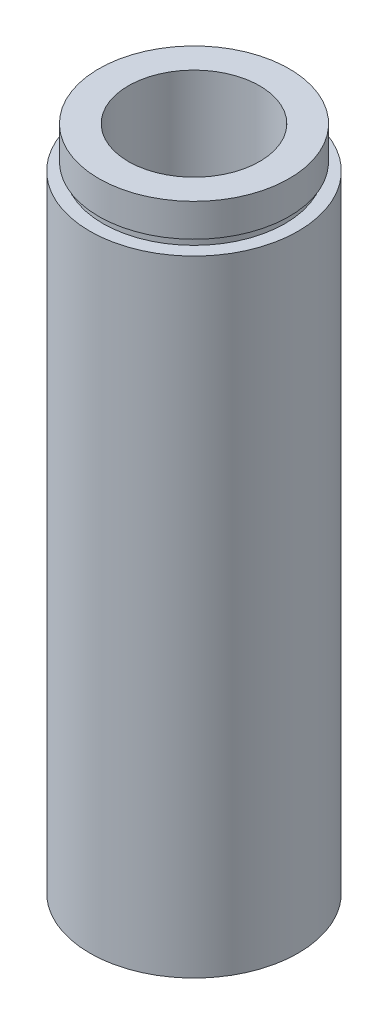
ISO-10303-21;
HEADER;
FILE_DESCRIPTION(('STEP AP214'),'2;1');
FILE_NAME('part.step','',(''),(''),'','','');
FILE_SCHEMA(('AUTOMOTIVE_DESIGN { 1 0 10303 214 1 1 1 1 }'));
ENDSEC;
DATA;
#1=APPLICATION_CONTEXT('core data for automotive mechanical design processes');
#2=APPLICATION_PROTOCOL_DEFINITION('international standard','automotive_design',2000,#1);
#3=PRODUCT_CONTEXT('',#1,'mechanical');
#4=PRODUCT('Part','Part','',(#3));
#5=PRODUCT_RELATED_PRODUCT_CATEGORY('part','',(#4));
#6=PRODUCT_DEFINITION_FORMATION('','',#4);
#7=PRODUCT_DEFINITION_CONTEXT('part definition',#1,'design');
#8=PRODUCT_DEFINITION('design','',#6,#7);
#9=PRODUCT_DEFINITION_SHAPE('','',#8);
#10=(LENGTH_UNIT() NAMED_UNIT(*) SI_UNIT(.MILLI.,.METRE.));
#11=(NAMED_UNIT(*) PLANE_ANGLE_UNIT() SI_UNIT($,.RADIAN.));
#12=(NAMED_UNIT(*) SI_UNIT($,.STERADIAN.) SOLID_ANGLE_UNIT());
#13=UNCERTAINTY_MEASURE_WITH_UNIT(LENGTH_MEASURE(1.E-05),#10,'distance_accuracy_value','');
#14=(GEOMETRIC_REPRESENTATION_CONTEXT(3) GLOBAL_UNCERTAINTY_ASSIGNED_CONTEXT((#13)) GLOBAL_UNIT_ASSIGNED_CONTEXT((#10,
#11,#12)) REPRESENTATION_CONTEXT('',''));
#15=CARTESIAN_POINT('',(0.,0.,0.));
#16=DIRECTION('',(0.,0.,1.));
#17=DIRECTION('',(1.,0.,0.));
#18=AXIS2_PLACEMENT_3D('',#15,#16,#17);
#19=CARTESIAN_POINT('',(11.1,0.,0.));
#20=DIRECTION('',(0.,1.,0.));
#21=DIRECTION('',(0.,0.,1.));
#22=AXIS2_PLACEMENT_3D('',#19,#20,#21);
#23=PLANE('',#22);
#24=CARTESIAN_POINT('',(0.,0.,0.));
#25=DIRECTION('',(0.,1.,0.));
#26=DIRECTION('',(0.,0.,1.));
#27=AXIS2_PLACEMENT_3D('',#24,#25,#26);
#28=CIRCLE('',#27,12.7);
#29=CARTESIAN_POINT('',(0.,0.,12.7));
#30=VERTEX_POINT('',#29);
#31=EDGE_CURVE('E10',#30,#30,#28,.T.);
#32=ORIENTED_EDGE('',*,*,#31,.F.);
#33=EDGE_LOOP('',(#32));
#34=FACE_BOUND('',#33,.T.);
#35=CARTESIAN_POINT('',(0.,0.,0.));
#36=DIRECTION('',(0.,1.,0.));
#37=DIRECTION('',(0.,0.,1.));
#38=AXIS2_PLACEMENT_3D('',#35,#36,#37);
#39=CIRCLE('',#38,11.1);
#40=CARTESIAN_POINT('',(0.,0.,11.1));
#41=VERTEX_POINT('',#40);
#42=EDGE_CURVE('E75',#41,#41,#39,.T.);
#43=ORIENTED_EDGE('',*,*,#42,.T.);
#44=EDGE_LOOP('',(#43));
#45=FACE_BOUND('',#44,.T.);
#46=ADVANCED_FACE('F35',(#34,#45),#23,.F.);
#47=CARTESIAN_POINT('',(0.,161.376166943427,0.));
#48=DIRECTION('',(0.,1.,0.));
#49=DIRECTION('',(0.,0.,1.));
#50=AXIS2_PLACEMENT_3D('',#47,#48,#49);
#51=CYLINDRICAL_SURFACE('',#50,12.7);
#52=CARTESIAN_POINT('',(0.,76.2,0.));
#53=DIRECTION('',(0.,1.,0.));
#54=DIRECTION('',(0.,0.,1.));
#55=AXIS2_PLACEMENT_3D('',#52,#53,#54);
#56=CIRCLE('',#55,12.7);
#57=CARTESIAN_POINT('',(0.,76.2,12.7));
#58=VERTEX_POINT('',#57);
#59=EDGE_CURVE('E41',#58,#58,#56,.T.);
#60=ORIENTED_EDGE('',*,*,#59,.F.);
#61=EDGE_LOOP('',(#60));
#62=FACE_BOUND('',#61,.T.);
#63=ORIENTED_EDGE('',*,*,#31,.T.);
#64=EDGE_LOOP('',(#63));
#65=FACE_BOUND('',#64,.T.);
#66=ADVANCED_FACE('F136',(#62,#65),#51,.T.);
#67=CARTESIAN_POINT('',(12.7,76.2,0.));
#68=DIRECTION('',(0.,-1.,0.));
#69=DIRECTION('',(0.,0.,-1.));
#70=AXIS2_PLACEMENT_3D('',#67,#68,#69);
#71=PLANE('',#70);
#72=CARTESIAN_POINT('',(0.,76.2,0.));
#73=DIRECTION('',(0.,1.,0.));
#74=DIRECTION('',(0.,0.,1.));
#75=AXIS2_PLACEMENT_3D('',#72,#73,#74);
#76=CIRCLE('',#75,11.1);
#77=CARTESIAN_POINT('',(0.,76.2,11.1));
#78=VERTEX_POINT('',#77);
#79=EDGE_CURVE('E45',#78,#78,#76,.T.);
#80=ORIENTED_EDGE('',*,*,#79,.F.);
#81=EDGE_LOOP('',(#80));
#82=FACE_BOUND('',#81,.T.);
#83=ORIENTED_EDGE('',*,*,#59,.T.);
#84=EDGE_LOOP('',(#83));
#85=FACE_BOUND('',#84,.T.);
#86=ADVANCED_FACE('F131',(#82,#85),#71,.F.);
#87=CARTESIAN_POINT('',(0.,161.376166943427,0.));
#88=DIRECTION('',(0.,1.,0.));
#89=DIRECTION('',(0.,0.,1.));
#90=AXIS2_PLACEMENT_3D('',#87,#88,#89);
#91=CYLINDRICAL_SURFACE('',#90,11.1);
#92=CARTESIAN_POINT('',(0.,77.2,0.));
#93=DIRECTION('',(0.,1.,0.));
#94=DIRECTION('',(0.,0.,1.));
#95=AXIS2_PLACEMENT_3D('',#92,#93,#94);
#96=CIRCLE('',#95,11.1);
#97=CARTESIAN_POINT('',(0.,77.2,11.1));
#98=VERTEX_POINT('',#97);
#99=EDGE_CURVE('E49',#98,#98,#96,.T.);
#100=ORIENTED_EDGE('',*,*,#99,.F.);
#101=EDGE_LOOP('',(#100));
#102=FACE_BOUND('',#101,.T.);
#103=ORIENTED_EDGE('',*,*,#79,.T.);
#104=EDGE_LOOP('',(#103));
#105=FACE_BOUND('',#104,.T.);
#106=ADVANCED_FACE('F125',(#102,#105),#91,.T.);
#107=CARTESIAN_POINT('',(11.1,77.2,0.));
#108=DIRECTION('',(0.,1.,0.));
#109=DIRECTION('',(0.,0.,1.));
#110=AXIS2_PLACEMENT_3D('',#107,#108,#109);
#111=PLANE('',#110);
#112=CARTESIAN_POINT('',(0.,77.2,0.));
#113=DIRECTION('',(0.,1.,0.));
#114=DIRECTION('',(0.,0.,1.));
#115=AXIS2_PLACEMENT_3D('',#112,#113,#114);
#116=CIRCLE('',#115,11.6);
#117=CARTESIAN_POINT('',(0.,77.2,11.6));
#118=VERTEX_POINT('',#117);
#119=EDGE_CURVE('E54',#118,#118,#116,.T.);
#120=ORIENTED_EDGE('',*,*,#119,.F.);
#121=EDGE_LOOP('',(#120));
#122=FACE_BOUND('',#121,.T.);
#123=ORIENTED_EDGE('',*,*,#99,.T.);
#124=EDGE_LOOP('',(#123));
#125=FACE_BOUND('',#124,.T.);
#126=ADVANCED_FACE('F119',(#122,#125),#111,.F.);
#127=CARTESIAN_POINT('',(0.,161.376166943427,0.));
#128=DIRECTION('',(0.,1.,0.));
#129=DIRECTION('',(0.,0.,1.));
#130=AXIS2_PLACEMENT_3D('',#127,#128,#129);
#131=CYLINDRICAL_SURFACE('',#130,11.6);
#132=CARTESIAN_POINT('',(0.,81.2,0.));
#133=DIRECTION('',(0.,1.,0.));
#134=DIRECTION('',(0.,0.,1.));
#135=AXIS2_PLACEMENT_3D('',#132,#133,#134);
#136=CIRCLE('',#135,11.6);
#137=CARTESIAN_POINT('',(0.,81.2,11.6));
#138=VERTEX_POINT('',#137);
#139=EDGE_CURVE('E57',#138,#138,#136,.T.);
#140=ORIENTED_EDGE('',*,*,#139,.F.);
#141=EDGE_LOOP('',(#140));
#142=FACE_BOUND('',#141,.T.);
#143=ORIENTED_EDGE('',*,*,#119,.T.);
#144=EDGE_LOOP('',(#143));
#145=FACE_BOUND('',#144,.T.);
#146=ADVANCED_FACE('F113',(#142,#145),#131,.T.);
#147=CARTESIAN_POINT('',(11.6,81.2,0.));
#148=DIRECTION('',(0.,-1.,0.));
#149=DIRECTION('',(0.,0.,-1.));
#150=AXIS2_PLACEMENT_3D('',#147,#148,#149);
#151=PLANE('',#150);
#152=CARTESIAN_POINT('',(0.,81.2,0.));
#153=DIRECTION('',(0.,1.,0.));
#154=DIRECTION('',(0.,0.,1.));
#155=AXIS2_PLACEMENT_3D('',#152,#153,#154);
#156=CIRCLE('',#155,8.00000000000002);
#157=CARTESIAN_POINT('',(0.,81.2,8.00000000000002));
#158=VERTEX_POINT('',#157);
#159=EDGE_CURVE('E60',#158,#158,#156,.T.);
#160=ORIENTED_EDGE('',*,*,#159,.F.);
#161=EDGE_LOOP('',(#160));
#162=FACE_BOUND('',#161,.T.);
#163=ORIENTED_EDGE('',*,*,#139,.T.);
#164=EDGE_LOOP('',(#163));
#165=FACE_BOUND('',#164,.T.);
#166=ADVANCED_FACE('F107',(#162,#165),#151,.F.);
#167=CARTESIAN_POINT('',(0.,161.376166943427,0.));
#168=DIRECTION('',(0.,1.,0.));
#169=DIRECTION('',(0.,0.,1.));
#170=AXIS2_PLACEMENT_3D('',#167,#168,#169);
#171=CYLINDRICAL_SURFACE('',#170,8.00000000000002);
#172=CARTESIAN_POINT('',(0.,5.49999999999998,0.));
#173=DIRECTION('',(0.,1.,0.));
#174=DIRECTION('',(0.,0.,1.));
#175=AXIS2_PLACEMENT_3D('',#172,#173,#174);
#176=CIRCLE('',#175,8.00000000000002);
#177=CARTESIAN_POINT('',(0.,5.49999999999998,8.00000000000002));
#178=VERTEX_POINT('',#177);
#179=EDGE_CURVE('E63',#178,#178,#176,.T.);
#180=ORIENTED_EDGE('',*,*,#179,.F.);
#181=EDGE_LOOP('',(#180));
#182=FACE_BOUND('',#181,.T.);
#183=ORIENTED_EDGE('',*,*,#159,.T.);
#184=EDGE_LOOP('',(#183));
#185=FACE_BOUND('',#184,.T.);
#186=ADVANCED_FACE('F101',(#182,#185),#171,.F.);
#187=CARTESIAN_POINT('',(11.7,5.49999999999998,0.));
#188=DIRECTION('',(0.,1.,0.));
#189=DIRECTION('',(0.,0.,1.));
#190=AXIS2_PLACEMENT_3D('',#187,#188,#189);
#191=PLANE('',#190);
#192=CARTESIAN_POINT('',(0.,5.49999999999998,0.));
#193=DIRECTION('',(0.,1.,0.));
#194=DIRECTION('',(0.,0.,1.));
#195=AXIS2_PLACEMENT_3D('',#192,#193,#194);
#196=CIRCLE('',#195,11.7);
#197=CARTESIAN_POINT('',(0.,5.49999999999998,11.7));
#198=VERTEX_POINT('',#197);
#199=EDGE_CURVE('E66',#198,#198,#196,.T.);
#200=ORIENTED_EDGE('',*,*,#199,.F.);
#201=EDGE_LOOP('',(#200));
#202=FACE_BOUND('',#201,.T.);
#203=ORIENTED_EDGE('',*,*,#179,.T.);
#204=EDGE_LOOP('',(#203));
#205=FACE_BOUND('',#204,.T.);
#206=ADVANCED_FACE('F95',(#202,#205),#191,.F.);
#207=CARTESIAN_POINT('',(0.,161.376166943427,0.));
#208=DIRECTION('',(0.,1.,0.));
#209=DIRECTION('',(0.,0.,1.));
#210=AXIS2_PLACEMENT_3D('',#207,#208,#209);
#211=CYLINDRICAL_SURFACE('',#210,11.7);
#212=CARTESIAN_POINT('',(0.,4.49999999999998,0.));
#213=DIRECTION('',(0.,1.,0.));
#214=DIRECTION('',(0.,0.,1.));
#215=AXIS2_PLACEMENT_3D('',#212,#213,#214);
#216=CIRCLE('',#215,11.7);
#217=CARTESIAN_POINT('',(0.,4.49999999999998,11.7));
#218=VERTEX_POINT('',#217);
#219=EDGE_CURVE('E69',#218,#218,#216,.T.);
#220=ORIENTED_EDGE('',*,*,#219,.F.);
#221=EDGE_LOOP('',(#220));
#222=FACE_BOUND('',#221,.T.);
#223=ORIENTED_EDGE('',*,*,#199,.T.);
#224=EDGE_LOOP('',(#223));
#225=FACE_BOUND('',#224,.T.);
#226=ADVANCED_FACE('F89',(#222,#225),#211,.F.);
#227=CARTESIAN_POINT('',(11.1,4.49999999999998,0.));
#228=DIRECTION('',(0.,-1.,0.));
#229=DIRECTION('',(0.,0.,-1.));
#230=AXIS2_PLACEMENT_3D('',#227,#228,#229);
#231=PLANE('',#230);
#232=CARTESIAN_POINT('',(0.,4.49999999999998,0.));
#233=DIRECTION('',(0.,1.,0.));
#234=DIRECTION('',(0.,0.,1.));
#235=AXIS2_PLACEMENT_3D('',#232,#233,#234);
#236=CIRCLE('',#235,11.1);
#237=CARTESIAN_POINT('',(0.,4.49999999999998,11.1));
#238=VERTEX_POINT('',#237);
#239=EDGE_CURVE('E72',#238,#238,#236,.T.);
#240=ORIENTED_EDGE('',*,*,#239,.F.);
#241=EDGE_LOOP('',(#240));
#242=FACE_BOUND('',#241,.T.);
#243=ORIENTED_EDGE('',*,*,#219,.T.);
#244=EDGE_LOOP('',(#243));
#245=FACE_BOUND('',#244,.T.);
#246=ADVANCED_FACE('F83',(#242,#245),#231,.F.);
#247=CARTESIAN_POINT('',(0.,161.376166943427,0.));
#248=DIRECTION('',(0.,1.,0.));
#249=DIRECTION('',(0.,0.,1.));
#250=AXIS2_PLACEMENT_3D('',#247,#248,#249);
#251=CYLINDRICAL_SURFACE('',#250,11.1);
#252=ORIENTED_EDGE('',*,*,#42,.F.);
#253=EDGE_LOOP('',(#252));
#254=FACE_BOUND('',#253,.T.);
#255=ORIENTED_EDGE('',*,*,#239,.T.);
#256=EDGE_LOOP('',(#255));
#257=FACE_BOUND('',#256,.T.);
#258=ADVANCED_FACE('F80',(#254,#257),#251,.F.);
#259=CLOSED_SHELL('',(#46,#66,#86,#106,#126,#146,#166,#186,#206,#226,#246,#258));
#260=MANIFOLD_SOLID_BREP('B2',#259);
#261=ADVANCED_BREP_SHAPE_REPRESENTATION('',(#18,#260),#14);
#262=SHAPE_DEFINITION_REPRESENTATION(#9,#261);
ENDSEC;
END-ISO-10303-21;
